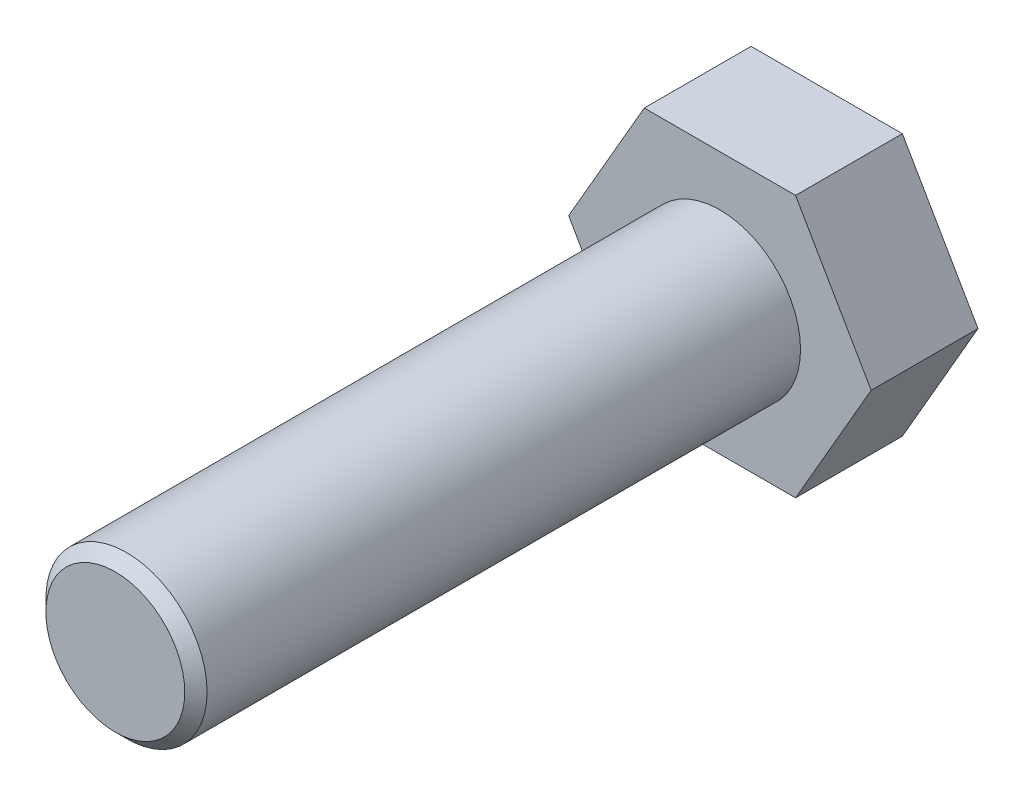
ISO-10303-21;
HEADER;
FILE_DESCRIPTION(('STEP AP214'),'2;1');
FILE_NAME('part.step','',(''),(''),'','','');
FILE_SCHEMA(('AUTOMOTIVE_DESIGN { 1 0 10303 214 1 1 1 1 }'));
ENDSEC;
DATA;
#1=APPLICATION_CONTEXT('core data for automotive mechanical design processes');
#2=APPLICATION_PROTOCOL_DEFINITION('international standard','automotive_design',2000,#1);
#3=PRODUCT_CONTEXT('',#1,'mechanical');
#4=PRODUCT('Part','Part','',(#3));
#5=PRODUCT_RELATED_PRODUCT_CATEGORY('part','',(#4));
#6=PRODUCT_DEFINITION_FORMATION('','',#4);
#7=PRODUCT_DEFINITION_CONTEXT('part definition',#1,'design');
#8=PRODUCT_DEFINITION('design','',#6,#7);
#9=PRODUCT_DEFINITION_SHAPE('','',#8);
#10=(LENGTH_UNIT() NAMED_UNIT(*) SI_UNIT(.MILLI.,.METRE.));
#11=(NAMED_UNIT(*) PLANE_ANGLE_UNIT() SI_UNIT($,.RADIAN.));
#12=(NAMED_UNIT(*) SI_UNIT($,.STERADIAN.) SOLID_ANGLE_UNIT());
#13=UNCERTAINTY_MEASURE_WITH_UNIT(LENGTH_MEASURE(1.E-05),#10,'distance_accuracy_value','');
#14=(GEOMETRIC_REPRESENTATION_CONTEXT(3) GLOBAL_UNCERTAINTY_ASSIGNED_CONTEXT((#13)) GLOBAL_UNIT_ASSIGNED_CONTEXT((#10,
#11,#12)) REPRESENTATION_CONTEXT('',''));
#15=CARTESIAN_POINT('',(0.,0.,0.));
#16=DIRECTION('',(0.,0.,1.));
#17=DIRECTION('',(1.,0.,0.));
#18=AXIS2_PLACEMENT_3D('',#15,#16,#17);
#19=CARTESIAN_POINT('',(0.,0.,5.3));
#20=DIRECTION('',(0.,0.,0.999999999999982));
#21=DIRECTION('',(1.,0.,0.));
#22=AXIS2_PLACEMENT_3D('',#19,#20,#21);
#23=PLANE('',#22);
#24=DIRECTION('',(-0.500000000000002,0.866025403784438,0.));
#25=VECTOR('',#24,1.);
#26=CARTESIAN_POINT('',(7.50555349946543,0.,5.3));
#27=LINE('',#26,#25);
#28=CARTESIAN_POINT('',(7.50555349946543,0.,5.3));
#29=VERTEX_POINT('',#28);
#30=CARTESIAN_POINT('',(3.75277674973264,6.50000000000003,5.3));
#31=VERTEX_POINT('',#30);
#32=EDGE_CURVE('E137',#29,#31,#27,.T.);
#33=ORIENTED_EDGE('',*,*,#32,.T.);
#34=DIRECTION('',(-1.,0.,0.));
#35=VECTOR('',#34,1.);
#36=CARTESIAN_POINT('',(3.75277674973264,6.50000000000003,5.3));
#37=LINE('',#36,#35);
#38=CARTESIAN_POINT('',(-3.75277674973253,6.49999999999997,5.3));
#39=VERTEX_POINT('',#38);
#40=EDGE_CURVE('E95',#31,#39,#37,.T.);
#41=ORIENTED_EDGE('',*,*,#40,.T.);
#42=DIRECTION('',(-0.500000000000001,-0.866025403784438,0.));
#43=VECTOR('',#42,1.);
#44=CARTESIAN_POINT('',(-3.75277674973253,6.49999999999997,5.3));
#45=LINE('',#44,#43);
#46=CARTESIAN_POINT('',(-7.50555349946522,0.,5.3));
#47=VERTEX_POINT('',#46);
#48=EDGE_CURVE('E108',#39,#47,#45,.T.);
#49=ORIENTED_EDGE('',*,*,#48,.T.);
#50=DIRECTION('',(0.500000000000002,-0.866025403784437,0.));
#51=VECTOR('',#50,1.);
#52=CARTESIAN_POINT('',(-7.50555349946522,0.,5.3));
#53=LINE('',#52,#51);
#54=CARTESIAN_POINT('',(-3.75277674973258,-6.49999999999997,5.3));
#55=VERTEX_POINT('',#54);
#56=EDGE_CURVE('E102',#47,#55,#53,.T.);
#57=ORIENTED_EDGE('',*,*,#56,.T.);
#58=DIRECTION('',(1.,0.,0.));
#59=VECTOR('',#58,1.);
#60=CARTESIAN_POINT('',(-3.75277674973258,-6.49999999999997,5.3));
#61=LINE('',#60,#59);
#62=CARTESIAN_POINT('',(3.75277674973255,-6.50000000000001,5.3));
#63=VERTEX_POINT('',#62);
#64=EDGE_CURVE('E106',#55,#63,#61,.T.);
#65=ORIENTED_EDGE('',*,*,#64,.T.);
#66=DIRECTION('',(0.500000000000001,0.866025403784438,0.));
#67=VECTOR('',#66,1.);
#68=CARTESIAN_POINT('',(3.75277674973255,-6.50000000000001,5.3));
#69=LINE('',#68,#67);
#70=EDGE_CURVE('E57',#63,#29,#69,.T.);
#71=ORIENTED_EDGE('',*,*,#70,.T.);
#72=EDGE_LOOP('',(#33,#41,#49,#57,#65,#71));
#73=FACE_BOUND('',#72,.T.);
#74=CARTESIAN_POINT('',(0.,0.,5.3));
#75=DIRECTION('',(0.,0.,0.999999999999982));
#76=DIRECTION('',(1.,0.,0.));
#77=AXIS2_PLACEMENT_3D('',#74,#75,#76);
#78=CIRCLE('',#77,4.);
#79=CARTESIAN_POINT('',(4.00000000000001,0.,5.3));
#80=VERTEX_POINT('',#79);
#81=EDGE_CURVE('E130',#80,#80,#78,.T.);
#82=ORIENTED_EDGE('',*,*,#81,.F.);
#83=EDGE_LOOP('',(#82));
#84=FACE_BOUND('',#83,.T.);
#85=ADVANCED_FACE('F40',(#73,#84),#23,.T.);
#86=CARTESIAN_POINT('',(7.50555349946543,0.,5.3));
#87=DIRECTION('',(-0.866025403784445,-0.499999999999998,0.));
#88=DIRECTION('',(0.500000000000002,-0.866025403784438,0.));
#89=AXIS2_PLACEMENT_3D('',#86,#87,#88);
#90=PLANE('',#89);
#91=DIRECTION('',(-0.500000000000002,0.866025403784438,0.));
#92=VECTOR('',#91,1.);
#93=CARTESIAN_POINT('',(7.50555349946543,0.,0.));
#94=LINE('',#93,#92);
#95=CARTESIAN_POINT('',(7.50555349946543,0.,0.));
#96=VERTEX_POINT('',#95);
#97=CARTESIAN_POINT('',(3.75277674973264,6.50000000000001,0.));
#98=VERTEX_POINT('',#97);
#99=EDGE_CURVE('E126',#96,#98,#94,.T.);
#100=ORIENTED_EDGE('',*,*,#99,.T.);
#101=DIRECTION('',(0.,0.,-0.999999999999982));
#102=VECTOR('',#101,1.);
#103=CARTESIAN_POINT('',(3.75277674973264,6.50000000000003,5.3));
#104=LINE('',#103,#102);
#105=EDGE_CURVE('E144',#31,#98,#104,.T.);
#106=ORIENTED_EDGE('',*,*,#105,.F.);
#107=ORIENTED_EDGE('',*,*,#32,.F.);
#108=DIRECTION('',(0.,0.,-0.999999999999982));
#109=VECTOR('',#108,1.);
#110=CARTESIAN_POINT('',(7.50555349946543,0.,5.3));
#111=LINE('',#110,#109);
#112=EDGE_CURVE('E122',#29,#96,#111,.T.);
#113=ORIENTED_EDGE('',*,*,#112,.T.);
#114=EDGE_LOOP('',(#100,#106,#107,#113));
#115=FACE_BOUND('',#114,.T.);
#116=ADVANCED_FACE('F159',(#115),#90,.F.);
#117=CARTESIAN_POINT('',(3.75277674973264,6.50000000000003,5.3));
#118=DIRECTION('',(0.,-0.999999999999999,0.));
#119=DIRECTION('',(1.,0.,0.));
#120=AXIS2_PLACEMENT_3D('',#117,#118,#119);
#121=PLANE('',#120);
#122=DIRECTION('',(-1.,0.,0.));
#123=VECTOR('',#122,1.);
#124=CARTESIAN_POINT('',(3.75277674973264,6.50000000000001,0.));
#125=LINE('',#124,#123);
#126=CARTESIAN_POINT('',(-3.75277674973253,6.49999999999997,0.));
#127=VERTEX_POINT('',#126);
#128=EDGE_CURVE('E129',#98,#127,#125,.T.);
#129=ORIENTED_EDGE('',*,*,#128,.T.);
#130=DIRECTION('',(0.,0.,-0.999999999999982));
#131=VECTOR('',#130,1.);
#132=CARTESIAN_POINT('',(-3.75277674973253,6.49999999999997,5.3));
#133=LINE('',#132,#131);
#134=EDGE_CURVE('E141',#39,#127,#133,.T.);
#135=ORIENTED_EDGE('',*,*,#134,.F.);
#136=ORIENTED_EDGE('',*,*,#40,.F.);
#137=ORIENTED_EDGE('',*,*,#105,.T.);
#138=EDGE_LOOP('',(#129,#135,#136,#137));
#139=FACE_BOUND('',#138,.T.);
#140=ADVANCED_FACE('F164',(#139),#121,.F.);
#141=CARTESIAN_POINT('',(-3.75277674973253,6.49999999999997,5.3));
#142=DIRECTION('',(0.866025403784446,-0.499999999999998,0.));
#143=DIRECTION('',(0.500000000000001,0.866025403784438,0.));
#144=AXIS2_PLACEMENT_3D('',#141,#142,#143);
#145=PLANE('',#144);
#146=DIRECTION('',(-0.500000000000001,-0.866025403784438,0.));
#147=VECTOR('',#146,1.);
#148=CARTESIAN_POINT('',(-3.75277674973253,6.49999999999997,0.));
#149=LINE('',#148,#147);
#150=CARTESIAN_POINT('',(-7.50555349946522,0.,0.));
#151=VERTEX_POINT('',#150);
#152=EDGE_CURVE('E132',#127,#151,#149,.T.);
#153=ORIENTED_EDGE('',*,*,#152,.T.);
#154=DIRECTION('',(0.,0.,-0.999999999999982));
#155=VECTOR('',#154,1.);
#156=CARTESIAN_POINT('',(-7.50555349946522,0.,5.3));
#157=LINE('',#156,#155);
#158=EDGE_CURVE('E117',#47,#151,#157,.T.);
#159=ORIENTED_EDGE('',*,*,#158,.F.);
#160=ORIENTED_EDGE('',*,*,#48,.F.);
#161=ORIENTED_EDGE('',*,*,#134,.T.);
#162=EDGE_LOOP('',(#153,#159,#160,#161));
#163=FACE_BOUND('',#162,.T.);
#164=ADVANCED_FACE('F179',(#163),#145,.F.);
#165=CARTESIAN_POINT('',(-7.50555349946522,0.,5.3));
#166=DIRECTION('',(0.866025403784445,0.499999999999998,0.));
#167=DIRECTION('',(-0.500000000000002,0.866025403784437,0.));
#168=AXIS2_PLACEMENT_3D('',#165,#166,#167);
#169=PLANE('',#168);
#170=DIRECTION('',(0.500000000000002,-0.866025403784437,0.));
#171=VECTOR('',#170,1.);
#172=CARTESIAN_POINT('',(-7.50555349946522,0.,0.));
#173=LINE('',#172,#171);
#174=CARTESIAN_POINT('',(-3.7527767497324,-6.49999999999994,0.));
#175=VERTEX_POINT('',#174);
#176=EDGE_CURVE('E116',#151,#175,#173,.T.);
#177=ORIENTED_EDGE('',*,*,#176,.T.);
#178=DIRECTION('',(0.,0.,-0.999999999999982));
#179=VECTOR('',#178,1.);
#180=CARTESIAN_POINT('',(-3.75277674973258,-6.49999999999997,5.3));
#181=LINE('',#180,#179);
#182=EDGE_CURVE('E113',#55,#175,#181,.T.);
#183=ORIENTED_EDGE('',*,*,#182,.F.);
#184=ORIENTED_EDGE('',*,*,#56,.F.);
#185=ORIENTED_EDGE('',*,*,#158,.T.);
#186=EDGE_LOOP('',(#177,#183,#184,#185));
#187=FACE_BOUND('',#186,.T.);
#188=ADVANCED_FACE('F114',(#187),#169,.F.);
#189=CARTESIAN_POINT('',(-3.75277674973258,-6.49999999999997,5.3));
#190=DIRECTION('',(0.,0.999999999999999,0.));
#191=DIRECTION('',(0.,0.,0.999999999999982));
#192=AXIS2_PLACEMENT_3D('',#189,#190,#191);
#193=PLANE('',#192);
#194=DIRECTION('',(1.,0.,0.));
#195=VECTOR('',#194,1.);
#196=CARTESIAN_POINT('',(-3.7527767497324,-6.49999999999994,0.));
#197=LINE('',#196,#195);
#198=CARTESIAN_POINT('',(3.75277674973255,-6.50000000000001,0.));
#199=VERTEX_POINT('',#198);
#200=EDGE_CURVE('E80',#175,#199,#197,.T.);
#201=ORIENTED_EDGE('',*,*,#200,.T.);
#202=DIRECTION('',(0.,0.,-0.999999999999982));
#203=VECTOR('',#202,1.);
#204=CARTESIAN_POINT('',(3.75277674973255,-6.50000000000001,5.3));
#205=LINE('',#204,#203);
#206=EDGE_CURVE('E118',#63,#199,#205,.T.);
#207=ORIENTED_EDGE('',*,*,#206,.F.);
#208=ORIENTED_EDGE('',*,*,#64,.F.);
#209=ORIENTED_EDGE('',*,*,#182,.T.);
#210=EDGE_LOOP('',(#201,#207,#208,#209));
#211=FACE_BOUND('',#210,.T.);
#212=ADVANCED_FACE('F120',(#211),#193,.F.);
#213=CARTESIAN_POINT('',(3.75277674973255,-6.50000000000001,5.3));
#214=DIRECTION('',(-0.866025403784446,0.499999999999998,0.));
#215=DIRECTION('',(-0.500000000000002,-0.866025403784439,0.));
#216=AXIS2_PLACEMENT_3D('',#213,#214,#215);
#217=PLANE('',#216);
#218=DIRECTION('',(0.500000000000001,0.866025403784438,0.));
#219=VECTOR('',#218,1.);
#220=CARTESIAN_POINT('',(3.75277674973255,-6.50000000000001,0.));
#221=LINE('',#220,#219);
#222=EDGE_CURVE('E86',#199,#96,#221,.T.);
#223=ORIENTED_EDGE('',*,*,#222,.T.);
#224=ORIENTED_EDGE('',*,*,#112,.F.);
#225=ORIENTED_EDGE('',*,*,#70,.F.);
#226=ORIENTED_EDGE('',*,*,#206,.T.);
#227=EDGE_LOOP('',(#223,#224,#225,#226));
#228=FACE_BOUND('',#227,.T.);
#229=ADVANCED_FACE('F171',(#228),#217,.F.);
#230=CARTESIAN_POINT('',(0.,0.,0.));
#231=DIRECTION('',(0.,0.,0.999999999999982));
#232=DIRECTION('',(1.,0.,0.));
#233=AXIS2_PLACEMENT_3D('',#230,#231,#232);
#234=PLANE('',#233);
#235=ORIENTED_EDGE('',*,*,#99,.F.);
#236=ORIENTED_EDGE('',*,*,#222,.F.);
#237=ORIENTED_EDGE('',*,*,#200,.F.);
#238=ORIENTED_EDGE('',*,*,#176,.F.);
#239=ORIENTED_EDGE('',*,*,#152,.F.);
#240=ORIENTED_EDGE('',*,*,#128,.F.);
#241=EDGE_LOOP('',(#235,#236,#237,#238,#239,#240));
#242=FACE_BOUND('',#241,.T.);
#243=ADVANCED_FACE('F168',(#242),#234,.F.);
#244=CARTESIAN_POINT('',(0.,0.,35.2999999999994));
#245=DIRECTION('',(0.,0.,-0.999999999999982));
#246=DIRECTION('',(-1.,0.,0.));
#247=AXIS2_PLACEMENT_3D('',#244,#245,#246);
#248=CYLINDRICAL_SURFACE('',#247,4.);
#249=CARTESIAN_POINT('',(0.,0.,34.7454999999994));
#250=DIRECTION('',(0.,0.,0.999999999999982));
#251=DIRECTION('',(1.,0.,0.));
#252=AXIS2_PLACEMENT_3D('',#249,#250,#251);
#253=CIRCLE('',#252,4.);
#254=CARTESIAN_POINT('',(4.00000000000001,0.,34.7454999999994));
#255=VERTEX_POINT('',#254);
#256=EDGE_CURVE('E11',#255,#255,#253,.F.);
#257=ORIENTED_EDGE('',*,*,#256,.T.);
#258=EDGE_LOOP('',(#257));
#259=FACE_BOUND('',#258,.T.);
#260=ORIENTED_EDGE('',*,*,#81,.T.);
#261=EDGE_LOOP('',(#260));
#262=FACE_BOUND('',#261,.T.);
#263=ADVANCED_FACE('F155',(#259,#262),#248,.T.);
#264=CARTESIAN_POINT('',(0.,0.,35.2999999999994));
#265=DIRECTION('',(0.,0.,0.999999999999982));
#266=DIRECTION('',(1.,0.,0.));
#267=AXIS2_PLACEMENT_3D('',#264,#265,#266);
#268=PLANE('',#267);
#269=CARTESIAN_POINT('',(0.,0.,35.2999999999994));
#270=DIRECTION('',(0.,0.,0.999999999999982));
#271=DIRECTION('',(1.,0.,0.));
#272=AXIS2_PLACEMENT_3D('',#269,#270,#271);
#273=CIRCLE('',#272,3.44549999999999);
#274=CARTESIAN_POINT('',(3.4455,0.,35.2999999999994));
#275=VERTEX_POINT('',#274);
#276=EDGE_CURVE('E49',#275,#275,#273,.T.);
#277=ORIENTED_EDGE('',*,*,#276,.T.);
#278=EDGE_LOOP('',(#277));
#279=FACE_BOUND('',#278,.T.);
#280=ADVANCED_FACE('F148',(#279),#268,.T.);
#281=CARTESIAN_POINT('',(0.,0.,35.2999999999994));
#282=DIRECTION('',(0.,0.,-0.999999999999982));
#283=DIRECTION('',(-1.,0.,0.));
#284=AXIS2_PLACEMENT_3D('',#281,#282,#283);
#285=CONICAL_SURFACE('',#284,3.44549999999999,0.785398163397451);
#286=ORIENTED_EDGE('',*,*,#256,.F.);
#287=EDGE_LOOP('',(#286));
#288=FACE_BOUND('',#287,.T.);
#289=ORIENTED_EDGE('',*,*,#276,.F.);
#290=EDGE_LOOP('',(#289));
#291=FACE_BOUND('',#290,.T.);
#292=ADVANCED_FACE('F42',(#288,#291),#285,.T.);
#293=CLOSED_SHELL('',(#85,#116,#140,#164,#188,#212,#229,#243,#263,#280,#292));
#294=MANIFOLD_SOLID_BREP('B2',#293);
#295=ADVANCED_BREP_SHAPE_REPRESENTATION('',(#18,#294),#14);
#296=SHAPE_DEFINITION_REPRESENTATION(#9,#295);
ENDSEC;
END-ISO-10303-21;
